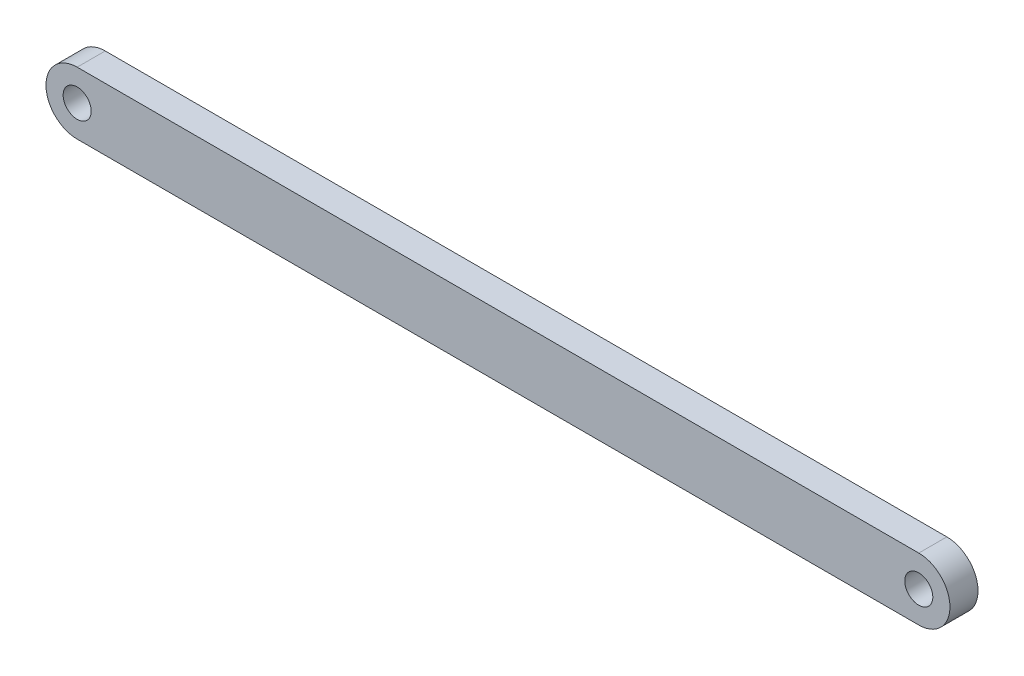
ISO-10303-21;
HEADER;
FILE_DESCRIPTION(('STEP AP214'),'2;1');
FILE_NAME('part.step','',(''),(''),'','','');
FILE_SCHEMA(('AUTOMOTIVE_DESIGN { 1 0 10303 214 1 1 1 1 }'));
ENDSEC;
DATA;
#1=APPLICATION_CONTEXT('core data for automotive mechanical design processes');
#2=APPLICATION_PROTOCOL_DEFINITION('international standard','automotive_design',2000,#1);
#3=PRODUCT_CONTEXT('',#1,'mechanical');
#4=PRODUCT('Part','Part','',(#3));
#5=PRODUCT_RELATED_PRODUCT_CATEGORY('part','',(#4));
#6=PRODUCT_DEFINITION_FORMATION('','',#4);
#7=PRODUCT_DEFINITION_CONTEXT('part definition',#1,'design');
#8=PRODUCT_DEFINITION('design','',#6,#7);
#9=PRODUCT_DEFINITION_SHAPE('','',#8);
#10=(LENGTH_UNIT() NAMED_UNIT(*) SI_UNIT(.MILLI.,.METRE.));
#11=(NAMED_UNIT(*) PLANE_ANGLE_UNIT() SI_UNIT($,.RADIAN.));
#12=(NAMED_UNIT(*) SI_UNIT($,.STERADIAN.) SOLID_ANGLE_UNIT());
#13=UNCERTAINTY_MEASURE_WITH_UNIT(LENGTH_MEASURE(1.E-05),#10,'distance_accuracy_value','');
#14=(GEOMETRIC_REPRESENTATION_CONTEXT(3) GLOBAL_UNCERTAINTY_ASSIGNED_CONTEXT((#13)) GLOBAL_UNIT_ASSIGNED_CONTEXT((#10,
#11,#12)) REPRESENTATION_CONTEXT('',''));
#15=CARTESIAN_POINT('',(0.,0.,0.));
#16=DIRECTION('',(0.,0.,1.));
#17=DIRECTION('',(1.,0.,0.));
#18=AXIS2_PLACEMENT_3D('',#15,#16,#17);
#19=CARTESIAN_POINT('',(540.,0.,18.));
#20=DIRECTION('',(0.,0.,-1.));
#21=DIRECTION('',(-1.,0.,0.));
#22=AXIS2_PLACEMENT_3D('',#19,#20,#21);
#23=PLANE('',#22);
#24=CARTESIAN_POINT('',(540.,0.,18.));
#25=DIRECTION('',(0.,0.,1.));
#26=DIRECTION('',(-1.,0.,0.));
#27=AXIS2_PLACEMENT_3D('',#24,#25,#26);
#28=CIRCLE('',#27,20.0000000000003);
#29=CARTESIAN_POINT('',(539.999995511273,-20.,18.));
#30=VERTEX_POINT('',#29);
#31=CARTESIAN_POINT('',(540.,20.,18.));
#32=VERTEX_POINT('',#31);
#33=EDGE_CURVE('E92',#30,#32,#28,.T.);
#34=ORIENTED_EDGE('',*,*,#33,.T.);
#35=DIRECTION('',(-1.,0.,0.));
#36=VECTOR('',#35,1.);
#37=CARTESIAN_POINT('',(0.,20.,18.));
#38=LINE('',#37,#36);
#39=CARTESIAN_POINT('',(0.,20.,18.));
#40=VERTEX_POINT('',#39);
#41=EDGE_CURVE('E87',#32,#40,#38,.T.);
#42=ORIENTED_EDGE('',*,*,#41,.T.);
#43=CARTESIAN_POINT('',(0.,0.,18.));
#44=DIRECTION('',(0.,0.,1.));
#45=DIRECTION('',(1.,0.,0.));
#46=AXIS2_PLACEMENT_3D('',#43,#44,#45);
#47=CIRCLE('',#46,20.);
#48=CARTESIAN_POINT('',(0.,-20.,18.));
#49=VERTEX_POINT('',#48);
#50=EDGE_CURVE('E90',#40,#49,#47,.T.);
#51=ORIENTED_EDGE('',*,*,#50,.T.);
#52=DIRECTION('',(1.,0.,0.));
#53=VECTOR('',#52,1.);
#54=CARTESIAN_POINT('',(0.,-20.,18.));
#55=LINE('',#54,#53);
#56=EDGE_CURVE('E57',#49,#30,#55,.T.);
#57=ORIENTED_EDGE('',*,*,#56,.T.);
#58=EDGE_LOOP('',(#34,#42,#51,#57));
#59=FACE_BOUND('',#58,.T.);
#60=CARTESIAN_POINT('',(0.,0.,18.));
#61=DIRECTION('',(0.,0.,1.));
#62=DIRECTION('',(1.,0.,0.));
#63=AXIS2_PLACEMENT_3D('',#60,#61,#62);
#64=CIRCLE('',#63,9.);
#65=CARTESIAN_POINT('',(9.,0.,18.));
#66=VERTEX_POINT('',#65);
#67=EDGE_CURVE('E112',#66,#66,#64,.T.);
#68=ORIENTED_EDGE('',*,*,#67,.F.);
#69=EDGE_LOOP('',(#68));
#70=FACE_BOUND('',#69,.T.);
#71=CARTESIAN_POINT('',(540.,0.,18.));
#72=DIRECTION('',(0.,0.,1.));
#73=DIRECTION('',(-1.,0.,0.));
#74=AXIS2_PLACEMENT_3D('',#71,#72,#73);
#75=CIRCLE('',#74,9.00000000000004);
#76=CARTESIAN_POINT('',(531.,0.,18.));
#77=VERTEX_POINT('',#76);
#78=EDGE_CURVE('E134',#77,#77,#75,.T.);
#79=ORIENTED_EDGE('',*,*,#78,.F.);
#80=EDGE_LOOP('',(#79));
#81=FACE_BOUND('',#80,.T.);
#82=ADVANCED_FACE('F39',(#59,#70,#81),#23,.F.);
#83=CARTESIAN_POINT('',(540.,0.,0.));
#84=DIRECTION('',(0.,0.,-1.));
#85=DIRECTION('',(-1.,0.,0.));
#86=AXIS2_PLACEMENT_3D('',#83,#84,#85);
#87=PLANE('',#86);
#88=CARTESIAN_POINT('',(0.,0.,0.));
#89=DIRECTION('',(0.,0.,1.));
#90=DIRECTION('',(1.,0.,0.));
#91=AXIS2_PLACEMENT_3D('',#88,#89,#90);
#92=CIRCLE('',#91,9.);
#93=CARTESIAN_POINT('',(9.,0.,0.));
#94=VERTEX_POINT('',#93);
#95=EDGE_CURVE('E130',#94,#94,#92,.T.);
#96=ORIENTED_EDGE('',*,*,#95,.T.);
#97=EDGE_LOOP('',(#96));
#98=FACE_BOUND('',#97,.T.);
#99=CARTESIAN_POINT('',(540.,0.,0.));
#100=DIRECTION('',(0.,0.,1.));
#101=DIRECTION('',(-1.,0.,0.));
#102=AXIS2_PLACEMENT_3D('',#99,#100,#101);
#103=CIRCLE('',#102,20.0000000000003);
#104=CARTESIAN_POINT('',(539.999995511273,-20.,0.));
#105=VERTEX_POINT('',#104);
#106=CARTESIAN_POINT('',(540.,20.,0.));
#107=VERTEX_POINT('',#106);
#108=EDGE_CURVE('E108',#105,#107,#103,.T.);
#109=ORIENTED_EDGE('',*,*,#108,.F.);
#110=DIRECTION('',(1.,0.,0.));
#111=VECTOR('',#110,1.);
#112=CARTESIAN_POINT('',(0.,-20.,0.));
#113=LINE('',#112,#111);
#114=CARTESIAN_POINT('',(0.,-20.,0.));
#115=VERTEX_POINT('',#114);
#116=EDGE_CURVE('E80',#115,#105,#113,.T.);
#117=ORIENTED_EDGE('',*,*,#116,.F.);
#118=CARTESIAN_POINT('',(0.,0.,0.));
#119=DIRECTION('',(0.,0.,1.));
#120=DIRECTION('',(1.,0.,0.));
#121=AXIS2_PLACEMENT_3D('',#118,#119,#120);
#122=CIRCLE('',#121,20.);
#123=CARTESIAN_POINT('',(0.,20.,0.));
#124=VERTEX_POINT('',#123);
#125=EDGE_CURVE('E74',#124,#115,#122,.T.);
#126=ORIENTED_EDGE('',*,*,#125,.F.);
#127=DIRECTION('',(-1.,0.,0.));
#128=VECTOR('',#127,1.);
#129=CARTESIAN_POINT('',(0.,20.,0.));
#130=LINE('',#129,#128);
#131=EDGE_CURVE('E97',#107,#124,#130,.T.);
#132=ORIENTED_EDGE('',*,*,#131,.F.);
#133=EDGE_LOOP('',(#109,#117,#126,#132));
#134=FACE_BOUND('',#133,.T.);
#135=CARTESIAN_POINT('',(540.,0.,0.));
#136=DIRECTION('',(0.,0.,1.));
#137=DIRECTION('',(-1.,0.,0.));
#138=AXIS2_PLACEMENT_3D('',#135,#136,#137);
#139=CIRCLE('',#138,9.00000000000004);
#140=CARTESIAN_POINT('',(531.,0.,0.));
#141=VERTEX_POINT('',#140);
#142=EDGE_CURVE('E138',#141,#141,#139,.T.);
#143=ORIENTED_EDGE('',*,*,#142,.T.);
#144=EDGE_LOOP('',(#143));
#145=FACE_BOUND('',#144,.T.);
#146=ADVANCED_FACE('F125',(#98,#134,#145),#87,.T.);
#147=CARTESIAN_POINT('',(540.,0.,18.));
#148=DIRECTION('',(0.,0.,-1.));
#149=DIRECTION('',(-1.,0.,0.));
#150=AXIS2_PLACEMENT_3D('',#147,#148,#149);
#151=CYLINDRICAL_SURFACE('',#150,20.0000000000003);
#152=ORIENTED_EDGE('',*,*,#108,.T.);
#153=DIRECTION('',(0.,0.,-1.));
#154=VECTOR('',#153,1.);
#155=CARTESIAN_POINT('',(540.,20.,18.));
#156=LINE('',#155,#154);
#157=EDGE_CURVE('E11',#32,#107,#156,.T.);
#158=ORIENTED_EDGE('',*,*,#157,.F.);
#159=ORIENTED_EDGE('',*,*,#33,.F.);
#160=DIRECTION('',(0.,0.,-1.));
#161=VECTOR('',#160,1.);
#162=CARTESIAN_POINT('',(539.999995511273,-20.,18.));
#163=LINE('',#162,#161);
#164=EDGE_CURVE('E104',#30,#105,#163,.T.);
#165=ORIENTED_EDGE('',*,*,#164,.T.);
#166=EDGE_LOOP('',(#152,#158,#159,#165));
#167=FACE_BOUND('',#166,.T.);
#168=ADVANCED_FACE('F41',(#167),#151,.T.);
#169=CARTESIAN_POINT('',(0.,20.,18.));
#170=DIRECTION('',(0.,-1.,0.));
#171=DIRECTION('',(1.,0.,0.));
#172=AXIS2_PLACEMENT_3D('',#169,#170,#171);
#173=PLANE('',#172);
#174=ORIENTED_EDGE('',*,*,#131,.T.);
#175=DIRECTION('',(0.,0.,-1.));
#176=VECTOR('',#175,1.);
#177=CARTESIAN_POINT('',(0.,20.,18.));
#178=LINE('',#177,#176);
#179=EDGE_CURVE('E49',#40,#124,#178,.T.);
#180=ORIENTED_EDGE('',*,*,#179,.F.);
#181=ORIENTED_EDGE('',*,*,#41,.F.);
#182=ORIENTED_EDGE('',*,*,#157,.T.);
#183=EDGE_LOOP('',(#174,#180,#181,#182));
#184=FACE_BOUND('',#183,.T.);
#185=ADVANCED_FACE('F96',(#184),#173,.F.);
#186=CARTESIAN_POINT('',(0.,0.,18.));
#187=DIRECTION('',(0.,0.,-1.));
#188=DIRECTION('',(-1.,0.,0.));
#189=AXIS2_PLACEMENT_3D('',#186,#187,#188);
#190=CYLINDRICAL_SURFACE('',#189,20.);
#191=ORIENTED_EDGE('',*,*,#125,.T.);
#192=DIRECTION('',(0.,0.,-1.));
#193=VECTOR('',#192,1.);
#194=CARTESIAN_POINT('',(0.,-20.,18.));
#195=LINE('',#194,#193);
#196=EDGE_CURVE('E99',#49,#115,#195,.T.);
#197=ORIENTED_EDGE('',*,*,#196,.F.);
#198=ORIENTED_EDGE('',*,*,#50,.F.);
#199=ORIENTED_EDGE('',*,*,#179,.T.);
#200=EDGE_LOOP('',(#191,#197,#198,#199));
#201=FACE_BOUND('',#200,.T.);
#202=ADVANCED_FACE('F100',(#201),#190,.T.);
#203=CARTESIAN_POINT('',(0.,-20.,18.));
#204=DIRECTION('',(0.,1.,0.));
#205=DIRECTION('',(-1.,0.,0.));
#206=AXIS2_PLACEMENT_3D('',#203,#204,#205);
#207=PLANE('',#206);
#208=ORIENTED_EDGE('',*,*,#116,.T.);
#209=ORIENTED_EDGE('',*,*,#164,.F.);
#210=ORIENTED_EDGE('',*,*,#56,.F.);
#211=ORIENTED_EDGE('',*,*,#196,.T.);
#212=EDGE_LOOP('',(#208,#209,#210,#211));
#213=FACE_BOUND('',#212,.T.);
#214=ADVANCED_FACE('F122',(#213),#207,.F.);
#215=CARTESIAN_POINT('',(0.,0.,18.));
#216=DIRECTION('',(0.,0.,-1.));
#217=DIRECTION('',(-1.,0.,0.));
#218=AXIS2_PLACEMENT_3D('',#215,#216,#217);
#219=CYLINDRICAL_SURFACE('',#218,9.);
#220=ORIENTED_EDGE('',*,*,#67,.T.);
#221=EDGE_LOOP('',(#220));
#222=FACE_BOUND('',#221,.T.);
#223=ORIENTED_EDGE('',*,*,#95,.F.);
#224=EDGE_LOOP('',(#223));
#225=FACE_BOUND('',#224,.T.);
#226=ADVANCED_FACE('F157',(#222,#225),#219,.F.);
#227=CARTESIAN_POINT('',(540.,0.,18.));
#228=DIRECTION('',(0.,0.,-1.));
#229=DIRECTION('',(-1.,0.,0.));
#230=AXIS2_PLACEMENT_3D('',#227,#228,#229);
#231=CYLINDRICAL_SURFACE('',#230,9.00000000000004);
#232=ORIENTED_EDGE('',*,*,#78,.T.);
#233=EDGE_LOOP('',(#232));
#234=FACE_BOUND('',#233,.T.);
#235=ORIENTED_EDGE('',*,*,#142,.F.);
#236=EDGE_LOOP('',(#235));
#237=FACE_BOUND('',#236,.T.);
#238=ADVANCED_FACE('F146',(#234,#237),#231,.F.);
#239=CLOSED_SHELL('',(#82,#146,#168,#185,#202,#214,#226,#238));
#240=MANIFOLD_SOLID_BREP('B2',#239);
#241=ADVANCED_BREP_SHAPE_REPRESENTATION('',(#18,#240),#14);
#242=SHAPE_DEFINITION_REPRESENTATION(#9,#241);
ENDSEC;
END-ISO-10303-21;
